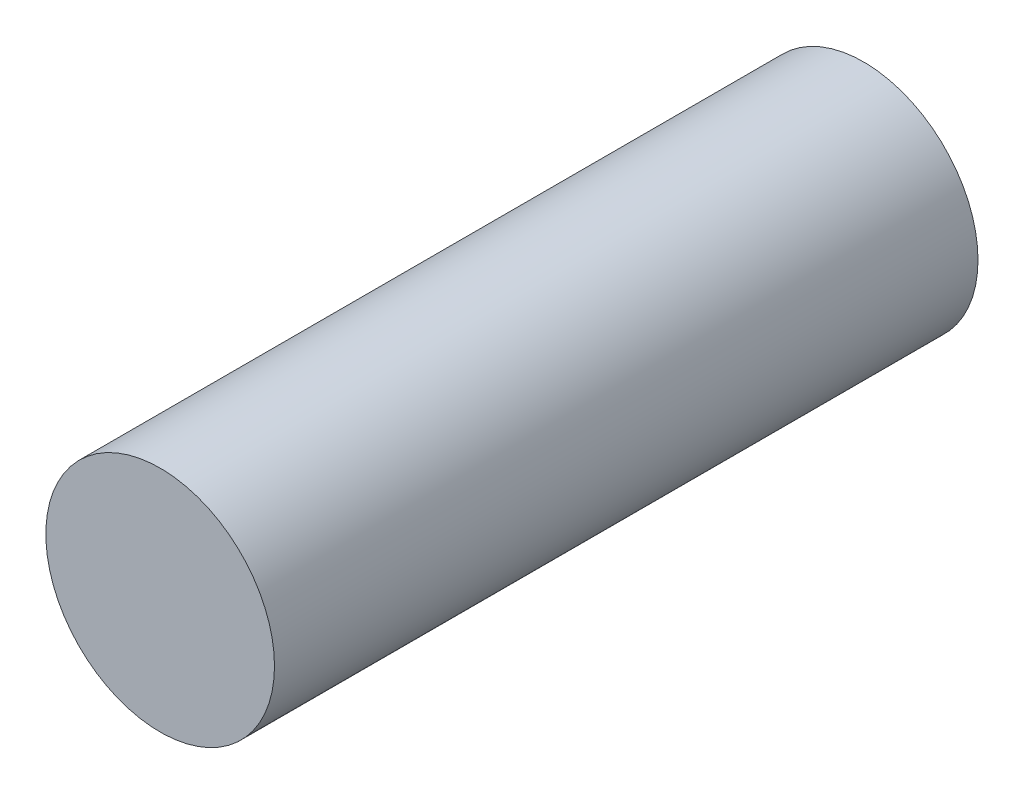
ISO-10303-21;
HEADER;
FILE_DESCRIPTION(('STEP AP214'),'2;1');
FILE_NAME('part.step','',(''),(''),'','','');
FILE_SCHEMA(('AUTOMOTIVE_DESIGN { 1 0 10303 214 1 1 1 1 }'));
ENDSEC;
DATA;
#1=APPLICATION_CONTEXT('core data for automotive mechanical design processes');
#2=APPLICATION_PROTOCOL_DEFINITION('international standard','automotive_design',2000,#1);
#3=PRODUCT_CONTEXT('',#1,'mechanical');
#4=PRODUCT('Part','Part','',(#3));
#5=PRODUCT_RELATED_PRODUCT_CATEGORY('part','',(#4));
#6=PRODUCT_DEFINITION_FORMATION('','',#4);
#7=PRODUCT_DEFINITION_CONTEXT('part definition',#1,'design');
#8=PRODUCT_DEFINITION('design','',#6,#7);
#9=PRODUCT_DEFINITION_SHAPE('','',#8);
#10=(LENGTH_UNIT() NAMED_UNIT(*) SI_UNIT(.MILLI.,.METRE.));
#11=(NAMED_UNIT(*) PLANE_ANGLE_UNIT() SI_UNIT($,.RADIAN.));
#12=(NAMED_UNIT(*) SI_UNIT($,.STERADIAN.) SOLID_ANGLE_UNIT());
#13=UNCERTAINTY_MEASURE_WITH_UNIT(LENGTH_MEASURE(1.E-05),#10,'distance_accuracy_value','');
#14=(GEOMETRIC_REPRESENTATION_CONTEXT(3) GLOBAL_UNCERTAINTY_ASSIGNED_CONTEXT((#13)) GLOBAL_UNIT_ASSIGNED_CONTEXT((#10,
#11,#12)) REPRESENTATION_CONTEXT('',''));
#15=CARTESIAN_POINT('',(0.,0.,0.));
#16=DIRECTION('',(0.,0.,1.));
#17=DIRECTION('',(1.,0.,0.));
#18=AXIS2_PLACEMENT_3D('',#15,#16,#17);
#19=CARTESIAN_POINT('',(0.,0.,40.));
#20=DIRECTION('',(0.,0.,-1.));
#21=DIRECTION('',(-1.,0.,0.));
#22=AXIS2_PLACEMENT_3D('',#19,#20,#21);
#23=CYLINDRICAL_SURFACE('',#22,6.5);
#24=CARTESIAN_POINT('',(0.,0.,40.));
#25=DIRECTION('',(0.,0.,1.));
#26=DIRECTION('',(1.,0.,0.));
#27=AXIS2_PLACEMENT_3D('',#24,#25,#26);
#28=CIRCLE('',#27,6.5);
#29=CARTESIAN_POINT('',(6.5,0.,40.));
#30=VERTEX_POINT('',#29);
#31=EDGE_CURVE('E10',#30,#30,#28,.T.);
#32=ORIENTED_EDGE('',*,*,#31,.F.);
#33=EDGE_LOOP('',(#32));
#34=FACE_BOUND('',#33,.T.);
#35=CARTESIAN_POINT('',(0.,0.,0.));
#36=DIRECTION('',(0.,0.,1.));
#37=DIRECTION('',(1.,0.,0.));
#38=AXIS2_PLACEMENT_3D('',#35,#36,#37);
#39=CIRCLE('',#38,6.5);
#40=CARTESIAN_POINT('',(6.5,0.,0.));
#41=VERTEX_POINT('',#40);
#42=EDGE_CURVE('E34',#41,#41,#39,.T.);
#43=ORIENTED_EDGE('',*,*,#42,.T.);
#44=EDGE_LOOP('',(#43));
#45=FACE_BOUND('',#44,.T.);
#46=ADVANCED_FACE('F31',(#34,#45),#23,.T.);
#47=CARTESIAN_POINT('',(0.,0.,40.));
#48=DIRECTION('',(0.,0.,1.));
#49=DIRECTION('',(1.,0.,0.));
#50=AXIS2_PLACEMENT_3D('',#47,#48,#49);
#51=PLANE('',#50);
#52=ORIENTED_EDGE('',*,*,#31,.T.);
#53=EDGE_LOOP('',(#52));
#54=FACE_BOUND('',#53,.T.);
#55=ADVANCED_FACE('F46',(#54),#51,.T.);
#56=CARTESIAN_POINT('',(0.,0.,0.));
#57=DIRECTION('',(0.,0.,1.));
#58=DIRECTION('',(1.,0.,0.));
#59=AXIS2_PLACEMENT_3D('',#56,#57,#58);
#60=PLANE('',#59);
#61=ORIENTED_EDGE('',*,*,#42,.F.);
#62=EDGE_LOOP('',(#61));
#63=FACE_BOUND('',#62,.T.);
#64=ADVANCED_FACE('F44',(#63),#60,.F.);
#65=CLOSED_SHELL('',(#46,#55,#64));
#66=MANIFOLD_SOLID_BREP('B2',#65);
#67=ADVANCED_BREP_SHAPE_REPRESENTATION('',(#18,#66),#14);
#68=SHAPE_DEFINITION_REPRESENTATION(#9,#67);
ENDSEC;
END-ISO-10303-21;
